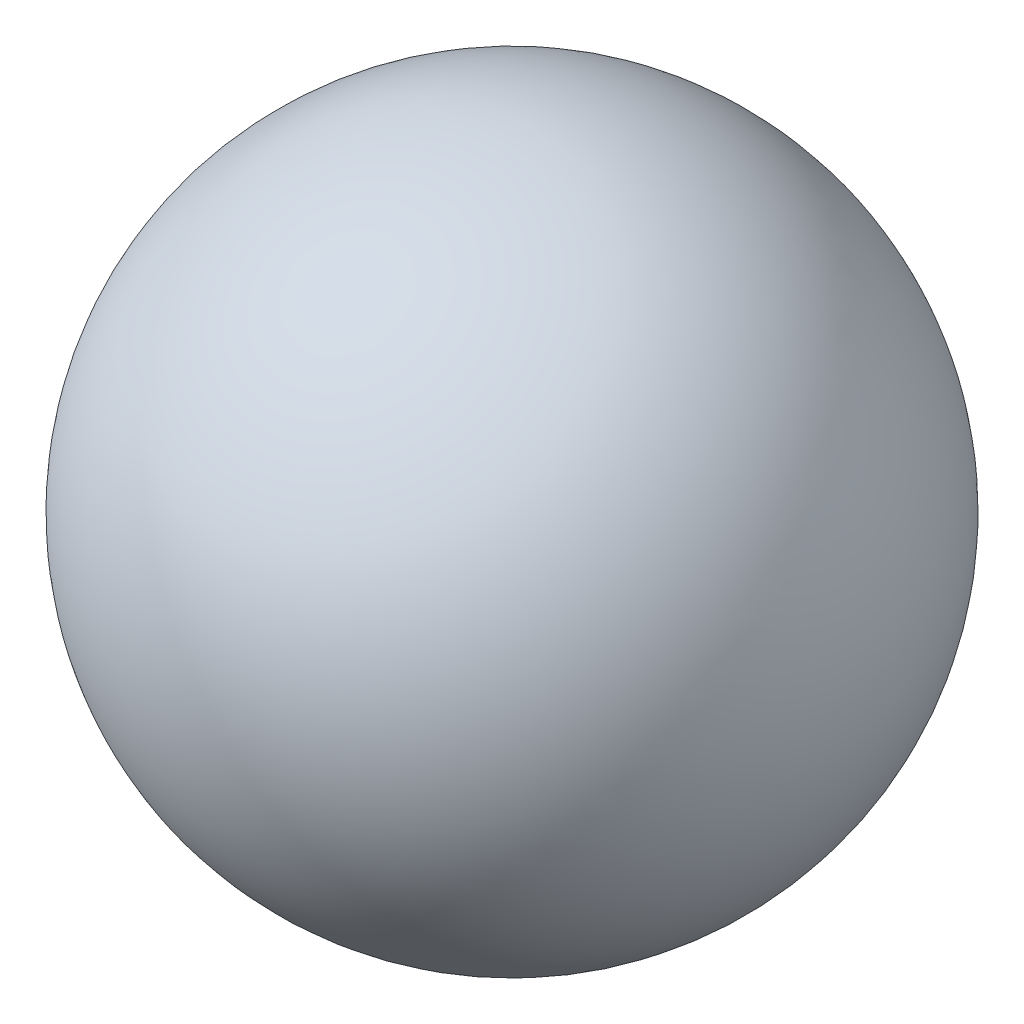
ISO-10303-21;
HEADER;
FILE_DESCRIPTION(('STEP AP214'),'2;1');
FILE_NAME('part.step','',(''),(''),'','','');
FILE_SCHEMA(('AUTOMOTIVE_DESIGN { 1 0 10303 214 1 1 1 1 }'));
ENDSEC;
DATA;
#1=APPLICATION_CONTEXT('core data for automotive mechanical design processes');
#2=APPLICATION_PROTOCOL_DEFINITION('international standard','automotive_design',2000,#1);
#3=PRODUCT_CONTEXT('',#1,'mechanical');
#4=PRODUCT('Part','Part','',(#3));
#5=PRODUCT_RELATED_PRODUCT_CATEGORY('part','',(#4));
#6=PRODUCT_DEFINITION_FORMATION('','',#4);
#7=PRODUCT_DEFINITION_CONTEXT('part definition',#1,'design');
#8=PRODUCT_DEFINITION('design','',#6,#7);
#9=PRODUCT_DEFINITION_SHAPE('','',#8);
#10=(LENGTH_UNIT() NAMED_UNIT(*) SI_UNIT(.MILLI.,.METRE.));
#11=(NAMED_UNIT(*) PLANE_ANGLE_UNIT() SI_UNIT($,.RADIAN.));
#12=(NAMED_UNIT(*) SI_UNIT($,.STERADIAN.) SOLID_ANGLE_UNIT());
#13=UNCERTAINTY_MEASURE_WITH_UNIT(LENGTH_MEASURE(1.E-05),#10,'distance_accuracy_value','');
#14=(GEOMETRIC_REPRESENTATION_CONTEXT(3) GLOBAL_UNCERTAINTY_ASSIGNED_CONTEXT((#13)) GLOBAL_UNIT_ASSIGNED_CONTEXT((#10,
#11,#12)) REPRESENTATION_CONTEXT('',''));
#15=CARTESIAN_POINT('',(0.,0.,0.));
#16=DIRECTION('',(0.,0.,1.));
#17=DIRECTION('',(1.,0.,0.));
#18=AXIS2_PLACEMENT_3D('',#15,#16,#17);
#19=CARTESIAN_POINT('',(-7.27705596283615,-3.,3.32332010401509));
#20=DIRECTION('',(0.,0.,1.));
#21=DIRECTION('',(1.,0.,0.));
#22=AXIS2_PLACEMENT_3D('',#19,#20,#21);
#23=SPHERICAL_SURFACE('',#22,1.8);
#24=CARTESIAN_POINT('',(-7.27705596283615,-3.,5.12332010401509));
#25=VERTEX_POINT('',#24);
#26=VERTEX_LOOP('',#25);
#27=FACE_BOUND('',#26,.T.);
#28=ADVANCED_FACE('F12',(#27),#23,.T.);
#29=CLOSED_SHELL('',(#28));
#30=MANIFOLD_SOLID_BREP('B1',#29);
#31=ADVANCED_BREP_SHAPE_REPRESENTATION('',(#18,#30),#14);
#32=SHAPE_DEFINITION_REPRESENTATION(#9,#31);
ENDSEC;
END-ISO-10303-21;
